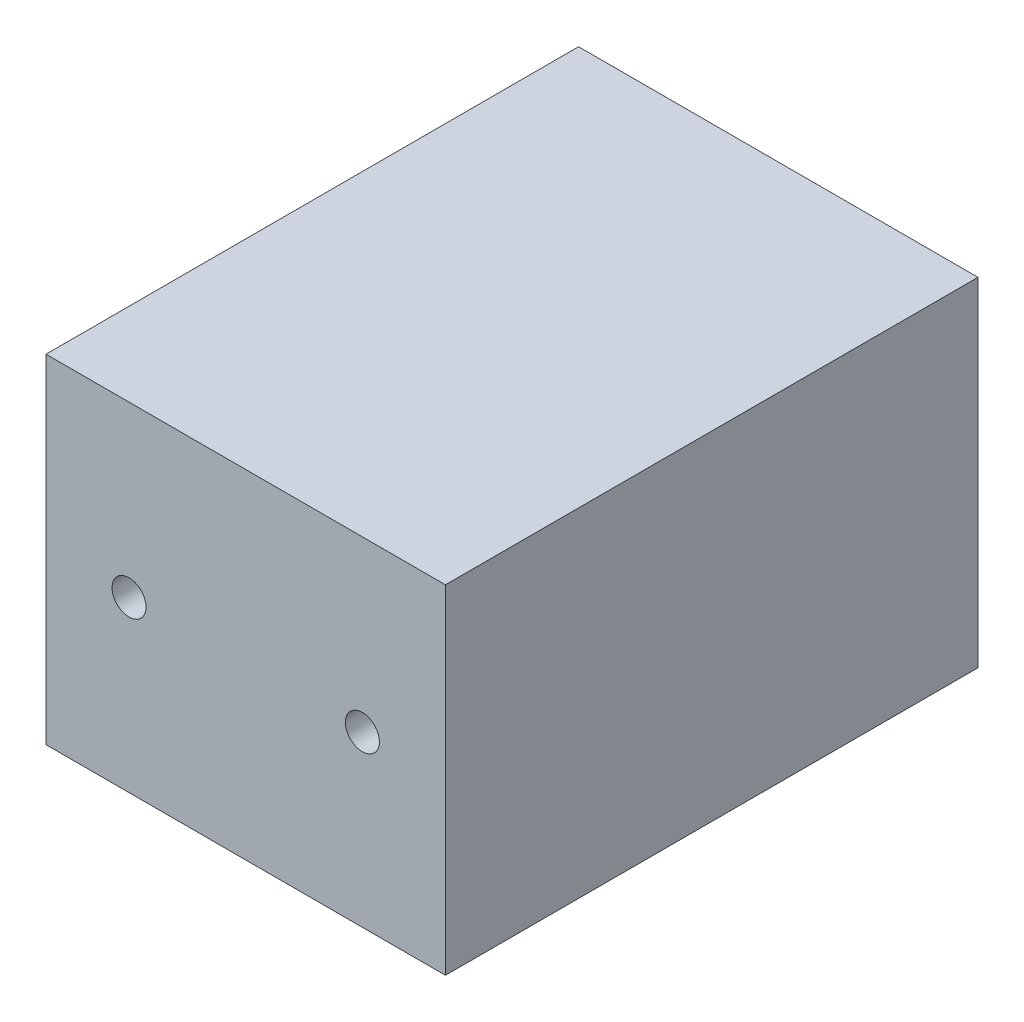
ISO-10303-21;
HEADER;
FILE_DESCRIPTION(('STEP AP214'),'2;1');
FILE_NAME('part.step','',(''),(''),'','','');
FILE_SCHEMA(('AUTOMOTIVE_DESIGN { 1 0 10303 214 1 1 1 1 }'));
ENDSEC;
DATA;
#1=APPLICATION_CONTEXT('core data for automotive mechanical design processes');
#2=APPLICATION_PROTOCOL_DEFINITION('international standard','automotive_design',2000,#1);
#3=PRODUCT_CONTEXT('',#1,'mechanical');
#4=PRODUCT('Part','Part','',(#3));
#5=PRODUCT_RELATED_PRODUCT_CATEGORY('part','',(#4));
#6=PRODUCT_DEFINITION_FORMATION('','',#4);
#7=PRODUCT_DEFINITION_CONTEXT('part definition',#1,'design');
#8=PRODUCT_DEFINITION('design','',#6,#7);
#9=PRODUCT_DEFINITION_SHAPE('','',#8);
#10=(LENGTH_UNIT() NAMED_UNIT(*) SI_UNIT(.MILLI.,.METRE.));
#11=(NAMED_UNIT(*) PLANE_ANGLE_UNIT() SI_UNIT($,.RADIAN.));
#12=(NAMED_UNIT(*) SI_UNIT($,.STERADIAN.) SOLID_ANGLE_UNIT());
#13=UNCERTAINTY_MEASURE_WITH_UNIT(LENGTH_MEASURE(1.E-05),#10,'distance_accuracy_value','');
#14=(GEOMETRIC_REPRESENTATION_CONTEXT(3) GLOBAL_UNCERTAINTY_ASSIGNED_CONTEXT((#13)) GLOBAL_UNIT_ASSIGNED_CONTEXT((#10,
#11,#12)) REPRESENTATION_CONTEXT('',''));
#15=CARTESIAN_POINT('',(0.,0.,0.));
#16=DIRECTION('',(0.,0.,1.));
#17=DIRECTION('',(1.,0.,0.));
#18=AXIS2_PLACEMENT_3D('',#15,#16,#17);
#19=CARTESIAN_POINT('',(0.,50.8,0.));
#20=DIRECTION('',(1.,0.,0.));
#21=DIRECTION('',(0.,0.,-1.));
#22=AXIS2_PLACEMENT_3D('',#19,#20,#21);
#23=PLANE('',#22);
#24=DIRECTION('',(0.,0.,1.));
#25=VECTOR('',#24,1.);
#26=CARTESIAN_POINT('',(0.,0.,0.));
#27=LINE('',#26,#25);
#28=CARTESIAN_POINT('',(0.,0.,-80.00000002));
#29=VERTEX_POINT('',#28);
#30=CARTESIAN_POINT('',(0.,0.,0.));
#31=VERTEX_POINT('',#30);
#32=EDGE_CURVE('E101',#29,#31,#27,.T.);
#33=ORIENTED_EDGE('',*,*,#32,.T.);
#34=DIRECTION('',(0.,-1.,0.));
#35=VECTOR('',#34,1.);
#36=CARTESIAN_POINT('',(0.,50.8,0.));
#37=LINE('',#36,#35);
#38=CARTESIAN_POINT('',(0.,50.8,0.));
#39=VERTEX_POINT('',#38);
#40=EDGE_CURVE('E11',#39,#31,#37,.T.);
#41=ORIENTED_EDGE('',*,*,#40,.F.);
#42=DIRECTION('',(0.,0.,1.));
#43=VECTOR('',#42,1.);
#44=CARTESIAN_POINT('',(0.,50.8,0.));
#45=LINE('',#44,#43);
#46=CARTESIAN_POINT('',(0.,50.8,-80.00000002));
#47=VERTEX_POINT('',#46);
#48=EDGE_CURVE('E89',#47,#39,#45,.T.);
#49=ORIENTED_EDGE('',*,*,#48,.F.);
#50=DIRECTION('',(0.,-1.,0.));
#51=VECTOR('',#50,1.);
#52=CARTESIAN_POINT('',(0.,50.8,-80.00000002));
#53=LINE('',#52,#51);
#54=EDGE_CURVE('E97',#47,#29,#53,.T.);
#55=ORIENTED_EDGE('',*,*,#54,.T.);
#56=EDGE_LOOP('',(#33,#41,#49,#55));
#57=FACE_BOUND('',#56,.T.);
#58=ADVANCED_FACE('F38',(#57),#23,.F.);
#59=CARTESIAN_POINT('',(0.,50.8,0.));
#60=DIRECTION('',(0.,0.,-1.));
#61=DIRECTION('',(-1.,0.,0.));
#62=AXIS2_PLACEMENT_3D('',#59,#60,#61);
#63=PLANE('',#62);
#64=CARTESIAN_POINT('',(12.474,25.4,0.));
#65=DIRECTION('',(0.,0.,1.));
#66=DIRECTION('',(1.,0.,0.));
#67=AXIS2_PLACEMENT_3D('',#64,#65,#66);
#68=CIRCLE('',#67,2.55269999999999);
#69=CARTESIAN_POINT('',(15.0267,25.4,0.));
#70=VERTEX_POINT('',#69);
#71=EDGE_CURVE('E123',#70,#70,#68,.T.);
#72=ORIENTED_EDGE('',*,*,#71,.F.);
#73=EDGE_LOOP('',(#72));
#74=FACE_BOUND('',#73,.T.);
#75=CARTESIAN_POINT('',(47.526,25.4,0.));
#76=DIRECTION('',(0.,0.,1.));
#77=DIRECTION('',(1.,0.,0.));
#78=AXIS2_PLACEMENT_3D('',#75,#76,#77);
#79=CIRCLE('',#78,2.55269999999999);
#80=CARTESIAN_POINT('',(50.0787,25.4,0.));
#81=VERTEX_POINT('',#80);
#82=EDGE_CURVE('E117',#81,#81,#79,.T.);
#83=ORIENTED_EDGE('',*,*,#82,.F.);
#84=EDGE_LOOP('',(#83));
#85=FACE_BOUND('',#84,.T.);
#86=DIRECTION('',(1.,0.,0.));
#87=VECTOR('',#86,1.);
#88=CARTESIAN_POINT('',(0.,0.,0.));
#89=LINE('',#88,#87);
#90=CARTESIAN_POINT('',(60.,0.,0.));
#91=VERTEX_POINT('',#90);
#92=EDGE_CURVE('E93',#31,#91,#89,.T.);
#93=ORIENTED_EDGE('',*,*,#92,.T.);
#94=DIRECTION('',(0.,-1.,0.));
#95=VECTOR('',#94,1.);
#96=CARTESIAN_POINT('',(60.,50.8,0.));
#97=LINE('',#96,#95);
#98=CARTESIAN_POINT('',(60.,50.8,0.));
#99=VERTEX_POINT('',#98);
#100=EDGE_CURVE('E46',#99,#91,#97,.T.);
#101=ORIENTED_EDGE('',*,*,#100,.F.);
#102=DIRECTION('',(1.,0.,0.));
#103=VECTOR('',#102,1.);
#104=CARTESIAN_POINT('',(0.,50.8,0.));
#105=LINE('',#104,#103);
#106=EDGE_CURVE('E84',#39,#99,#105,.T.);
#107=ORIENTED_EDGE('',*,*,#106,.F.);
#108=ORIENTED_EDGE('',*,*,#40,.T.);
#109=EDGE_LOOP('',(#93,#101,#107,#108));
#110=FACE_BOUND('',#109,.T.);
#111=ADVANCED_FACE('F92',(#74,#85,#110),#63,.F.);
#112=CARTESIAN_POINT('',(60.,50.8,0.));
#113=DIRECTION('',(-1.,0.,0.));
#114=DIRECTION('',(0.,0.,1.));
#115=AXIS2_PLACEMENT_3D('',#112,#113,#114);
#116=PLANE('',#115);
#117=DIRECTION('',(0.,0.,-1.));
#118=VECTOR('',#117,1.);
#119=CARTESIAN_POINT('',(60.,0.,0.));
#120=LINE('',#119,#118);
#121=CARTESIAN_POINT('',(60.,0.,-80.00000002));
#122=VERTEX_POINT('',#121);
#123=EDGE_CURVE('E71',#91,#122,#120,.T.);
#124=ORIENTED_EDGE('',*,*,#123,.T.);
#125=DIRECTION('',(0.,-1.,0.));
#126=VECTOR('',#125,1.);
#127=CARTESIAN_POINT('',(60.,50.8,-80.00000002));
#128=LINE('',#127,#126);
#129=CARTESIAN_POINT('',(60.,50.8,-80.00000002));
#130=VERTEX_POINT('',#129);
#131=EDGE_CURVE('E94',#130,#122,#128,.T.);
#132=ORIENTED_EDGE('',*,*,#131,.F.);
#133=DIRECTION('',(0.,0.,-1.));
#134=VECTOR('',#133,1.);
#135=CARTESIAN_POINT('',(60.,50.8,0.));
#136=LINE('',#135,#134);
#137=EDGE_CURVE('E87',#99,#130,#136,.T.);
#138=ORIENTED_EDGE('',*,*,#137,.F.);
#139=ORIENTED_EDGE('',*,*,#100,.T.);
#140=EDGE_LOOP('',(#124,#132,#138,#139));
#141=FACE_BOUND('',#140,.T.);
#142=ADVANCED_FACE('F95',(#141),#116,.F.);
#143=CARTESIAN_POINT('',(0.,50.8,-80.00000002));
#144=DIRECTION('',(0.,0.,1.));
#145=DIRECTION('',(1.,0.,0.));
#146=AXIS2_PLACEMENT_3D('',#143,#144,#145);
#147=PLANE('',#146);
#148=CARTESIAN_POINT('',(12.474,25.4,-80.00000002));
#149=DIRECTION('',(0.,0.,1.));
#150=DIRECTION('',(1.,0.,0.));
#151=AXIS2_PLACEMENT_3D('',#148,#149,#150);
#152=CIRCLE('',#151,2.55269999999998);
#153=CARTESIAN_POINT('',(15.0267,25.4,-80.00000002));
#154=VERTEX_POINT('',#153);
#155=EDGE_CURVE('E120',#154,#154,#152,.T.);
#156=ORIENTED_EDGE('',*,*,#155,.T.);
#157=EDGE_LOOP('',(#156));
#158=FACE_BOUND('',#157,.T.);
#159=CARTESIAN_POINT('',(47.526,25.4,-80.00000002));
#160=DIRECTION('',(0.,0.,1.));
#161=DIRECTION('',(1.,0.,0.));
#162=AXIS2_PLACEMENT_3D('',#159,#160,#161);
#163=CIRCLE('',#162,2.55269999999998);
#164=CARTESIAN_POINT('',(50.0787,25.4,-80.00000002));
#165=VERTEX_POINT('',#164);
#166=EDGE_CURVE('E104',#165,#165,#163,.T.);
#167=ORIENTED_EDGE('',*,*,#166,.T.);
#168=EDGE_LOOP('',(#167));
#169=FACE_BOUND('',#168,.T.);
#170=DIRECTION('',(-1.,0.,0.));
#171=VECTOR('',#170,1.);
#172=CARTESIAN_POINT('',(0.,0.,-80.00000002));
#173=LINE('',#172,#171);
#174=EDGE_CURVE('E77',#122,#29,#173,.T.);
#175=ORIENTED_EDGE('',*,*,#174,.T.);
#176=ORIENTED_EDGE('',*,*,#54,.F.);
#177=DIRECTION('',(-1.,0.,0.));
#178=VECTOR('',#177,1.);
#179=CARTESIAN_POINT('',(0.,50.8,-80.00000002));
#180=LINE('',#179,#178);
#181=EDGE_CURVE('E54',#130,#47,#180,.T.);
#182=ORIENTED_EDGE('',*,*,#181,.F.);
#183=ORIENTED_EDGE('',*,*,#131,.T.);
#184=EDGE_LOOP('',(#175,#176,#182,#183));
#185=FACE_BOUND('',#184,.T.);
#186=ADVANCED_FACE('F109',(#158,#169,#185),#147,.F.);
#187=CARTESIAN_POINT('',(0.,50.8,0.));
#188=DIRECTION('',(0.,-1.,0.));
#189=DIRECTION('',(0.,0.,-1.));
#190=AXIS2_PLACEMENT_3D('',#187,#188,#189);
#191=PLANE('',#190);
#192=ORIENTED_EDGE('',*,*,#48,.T.);
#193=ORIENTED_EDGE('',*,*,#106,.T.);
#194=ORIENTED_EDGE('',*,*,#137,.T.);
#195=ORIENTED_EDGE('',*,*,#181,.T.);
#196=EDGE_LOOP('',(#192,#193,#194,#195));
#197=FACE_BOUND('',#196,.T.);
#198=ADVANCED_FACE('F85',(#197),#191,.F.);
#199=CARTESIAN_POINT('',(0.,0.,0.));
#200=DIRECTION('',(0.,-1.,0.));
#201=DIRECTION('',(0.,0.,-1.));
#202=AXIS2_PLACEMENT_3D('',#199,#200,#201);
#203=PLANE('',#202);
#204=ORIENTED_EDGE('',*,*,#32,.F.);
#205=ORIENTED_EDGE('',*,*,#174,.F.);
#206=ORIENTED_EDGE('',*,*,#123,.F.);
#207=ORIENTED_EDGE('',*,*,#92,.F.);
#208=EDGE_LOOP('',(#204,#205,#206,#207));
#209=FACE_BOUND('',#208,.T.);
#210=ADVANCED_FACE('F112',(#209),#203,.T.);
#211=CARTESIAN_POINT('',(47.526,25.4,0.));
#212=DIRECTION('',(0.,0.,1.));
#213=DIRECTION('',(1.,0.,0.));
#214=AXIS2_PLACEMENT_3D('',#211,#212,#213);
#215=CYLINDRICAL_SURFACE('',#214,2.55269999999999);
#216=ORIENTED_EDGE('',*,*,#166,.F.);
#217=EDGE_LOOP('',(#216));
#218=FACE_BOUND('',#217,.T.);
#219=ORIENTED_EDGE('',*,*,#82,.T.);
#220=EDGE_LOOP('',(#219));
#221=FACE_BOUND('',#220,.T.);
#222=ADVANCED_FACE('F133',(#218,#221),#215,.F.);
#223=CARTESIAN_POINT('',(12.474,25.4,0.));
#224=DIRECTION('',(0.,0.,1.));
#225=DIRECTION('',(1.,0.,0.));
#226=AXIS2_PLACEMENT_3D('',#223,#224,#225);
#227=CYLINDRICAL_SURFACE('',#226,2.55269999999998);
#228=ORIENTED_EDGE('',*,*,#155,.F.);
#229=EDGE_LOOP('',(#228));
#230=FACE_BOUND('',#229,.T.);
#231=ORIENTED_EDGE('',*,*,#71,.T.);
#232=EDGE_LOOP('',(#231));
#233=FACE_BOUND('',#232,.T.);
#234=ADVANCED_FACE('F127',(#230,#233),#227,.F.);
#235=CLOSED_SHELL('',(#58,#111,#142,#186,#198,#210,#222,#234));
#236=MANIFOLD_SOLID_BREP('B2',#235);
#237=ADVANCED_BREP_SHAPE_REPRESENTATION('',(#18,#236),#14);
#238=SHAPE_DEFINITION_REPRESENTATION(#9,#237);
ENDSEC;
END-ISO-10303-21;
